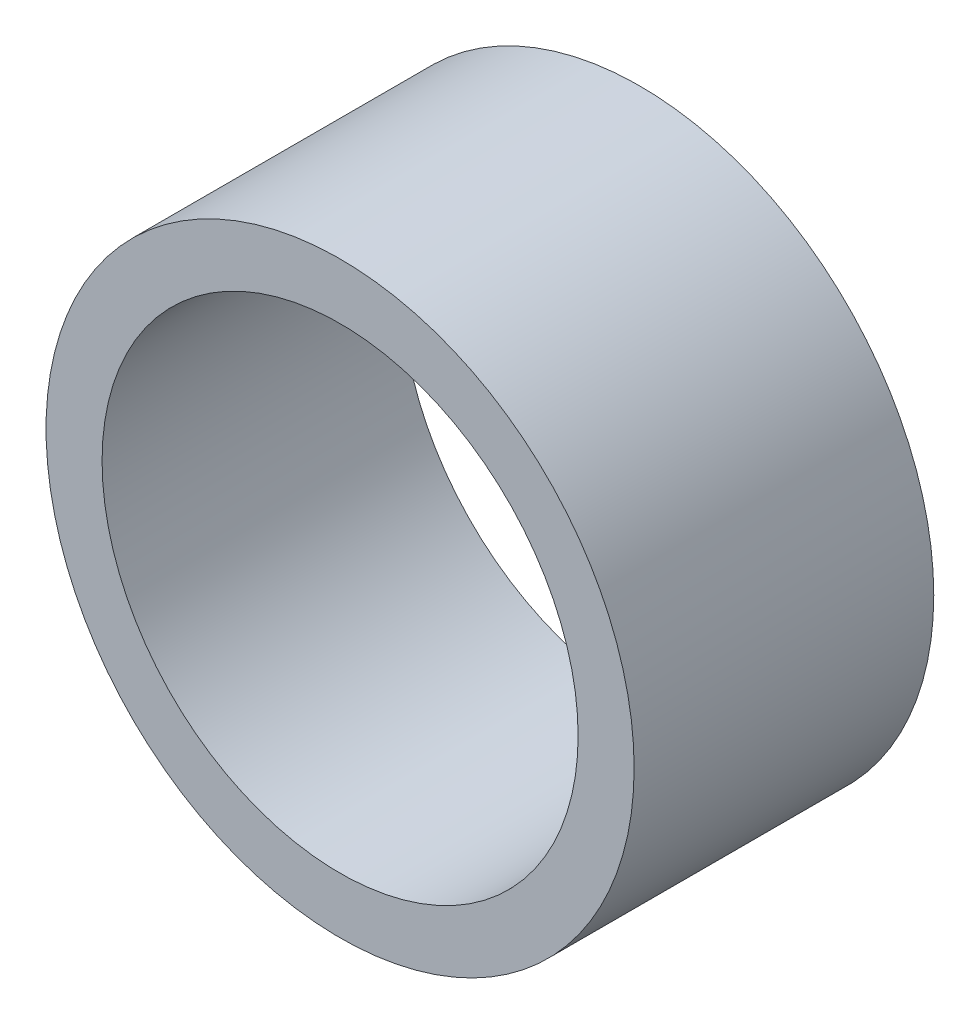
ISO-10303-21;
HEADER;
FILE_DESCRIPTION(('STEP AP214'),'2;1');
FILE_NAME('part.step','',(''),(''),'','','');
FILE_SCHEMA(('AUTOMOTIVE_DESIGN { 1 0 10303 214 1 1 1 1 }'));
ENDSEC;
DATA;
#1=APPLICATION_CONTEXT('core data for automotive mechanical design processes');
#2=APPLICATION_PROTOCOL_DEFINITION('international standard','automotive_design',2000,#1);
#3=PRODUCT_CONTEXT('',#1,'mechanical');
#4=PRODUCT('Part','Part','',(#3));
#5=PRODUCT_RELATED_PRODUCT_CATEGORY('part','',(#4));
#6=PRODUCT_DEFINITION_FORMATION('','',#4);
#7=PRODUCT_DEFINITION_CONTEXT('part definition',#1,'design');
#8=PRODUCT_DEFINITION('design','',#6,#7);
#9=PRODUCT_DEFINITION_SHAPE('','',#8);
#10=(LENGTH_UNIT() NAMED_UNIT(*) SI_UNIT(.MILLI.,.METRE.));
#11=(NAMED_UNIT(*) PLANE_ANGLE_UNIT() SI_UNIT($,.RADIAN.));
#12=(NAMED_UNIT(*) SI_UNIT($,.STERADIAN.) SOLID_ANGLE_UNIT());
#13=UNCERTAINTY_MEASURE_WITH_UNIT(LENGTH_MEASURE(1.E-05),#10,'distance_accuracy_value','');
#14=(GEOMETRIC_REPRESENTATION_CONTEXT(3) GLOBAL_UNCERTAINTY_ASSIGNED_CONTEXT((#13)) GLOBAL_UNIT_ASSIGNED_CONTEXT((#10,
#11,#12)) REPRESENTATION_CONTEXT('',''));
#15=CARTESIAN_POINT('',(0.,0.,0.));
#16=DIRECTION('',(0.,0.,1.));
#17=DIRECTION('',(1.,0.,0.));
#18=AXIS2_PLACEMENT_3D('',#15,#16,#17);
#19=CARTESIAN_POINT('',(0.,0.,10.7));
#20=DIRECTION('',(0.,0.,1.));
#21=DIRECTION('',(1.,0.,0.));
#22=AXIS2_PLACEMENT_3D('',#19,#20,#21);
#23=PLANE('',#22);
#24=CARTESIAN_POINT('',(0.,0.,10.7));
#25=DIRECTION('',(0.,0.,1.));
#26=DIRECTION('',(1.,0.,0.));
#27=AXIS2_PLACEMENT_3D('',#24,#25,#26);
#28=CIRCLE('',#27,10.5);
#29=CARTESIAN_POINT('',(10.5,0.,10.7));
#30=VERTEX_POINT('',#29);
#31=EDGE_CURVE('E10',#30,#30,#28,.T.);
#32=ORIENTED_EDGE('',*,*,#31,.T.);
#33=EDGE_LOOP('',(#32));
#34=FACE_BOUND('',#33,.T.);
#35=CARTESIAN_POINT('',(0.,0.,10.7));
#36=DIRECTION('',(0.,0.,1.));
#37=DIRECTION('',(1.,0.,0.));
#38=AXIS2_PLACEMENT_3D('',#35,#36,#37);
#39=CIRCLE('',#38,8.5);
#40=CARTESIAN_POINT('',(8.5,0.,10.7));
#41=VERTEX_POINT('',#40);
#42=EDGE_CURVE('E42',#41,#41,#39,.T.);
#43=ORIENTED_EDGE('',*,*,#42,.F.);
#44=EDGE_LOOP('',(#43));
#45=FACE_BOUND('',#44,.T.);
#46=ADVANCED_FACE('F31',(#34,#45),#23,.T.);
#47=CARTESIAN_POINT('',(0.,0.,0.));
#48=DIRECTION('',(0.,0.,1.));
#49=DIRECTION('',(1.,0.,0.));
#50=AXIS2_PLACEMENT_3D('',#47,#48,#49);
#51=PLANE('',#50);
#52=CARTESIAN_POINT('',(0.,0.,0.));
#53=DIRECTION('',(0.,0.,1.));
#54=DIRECTION('',(1.,0.,0.));
#55=AXIS2_PLACEMENT_3D('',#52,#53,#54);
#56=CIRCLE('',#55,10.5);
#57=CARTESIAN_POINT('',(10.5,0.,0.));
#58=VERTEX_POINT('',#57);
#59=EDGE_CURVE('E35',#58,#58,#56,.T.);
#60=ORIENTED_EDGE('',*,*,#59,.F.);
#61=EDGE_LOOP('',(#60));
#62=FACE_BOUND('',#61,.T.);
#63=CARTESIAN_POINT('',(0.,0.,0.));
#64=DIRECTION('',(0.,0.,1.));
#65=DIRECTION('',(1.,0.,0.));
#66=AXIS2_PLACEMENT_3D('',#63,#64,#65);
#67=CIRCLE('',#66,8.5);
#68=CARTESIAN_POINT('',(8.5,0.,0.));
#69=VERTEX_POINT('',#68);
#70=EDGE_CURVE('E44',#69,#69,#67,.T.);
#71=ORIENTED_EDGE('',*,*,#70,.T.);
#72=EDGE_LOOP('',(#71));
#73=FACE_BOUND('',#72,.T.);
#74=ADVANCED_FACE('F54',(#62,#73),#51,.F.);
#75=CARTESIAN_POINT('',(0.,0.,10.7));
#76=DIRECTION('',(0.,0.,-1.));
#77=DIRECTION('',(-1.,0.,0.));
#78=AXIS2_PLACEMENT_3D('',#75,#76,#77);
#79=CYLINDRICAL_SURFACE('',#78,10.5);
#80=ORIENTED_EDGE('',*,*,#31,.F.);
#81=EDGE_LOOP('',(#80));
#82=FACE_BOUND('',#81,.T.);
#83=ORIENTED_EDGE('',*,*,#59,.T.);
#84=EDGE_LOOP('',(#83));
#85=FACE_BOUND('',#84,.T.);
#86=ADVANCED_FACE('F33',(#82,#85),#79,.T.);
#87=CARTESIAN_POINT('',(0.,0.,10.7));
#88=DIRECTION('',(0.,0.,-1.));
#89=DIRECTION('',(-1.,0.,0.));
#90=AXIS2_PLACEMENT_3D('',#87,#88,#89);
#91=CYLINDRICAL_SURFACE('',#90,8.5);
#92=ORIENTED_EDGE('',*,*,#42,.T.);
#93=EDGE_LOOP('',(#92));
#94=FACE_BOUND('',#93,.T.);
#95=ORIENTED_EDGE('',*,*,#70,.F.);
#96=EDGE_LOOP('',(#95));
#97=FACE_BOUND('',#96,.T.);
#98=ADVANCED_FACE('F50',(#94,#97),#91,.F.);
#99=CLOSED_SHELL('',(#46,#74,#86,#98));
#100=MANIFOLD_SOLID_BREP('B2',#99);
#101=ADVANCED_BREP_SHAPE_REPRESENTATION('',(#18,#100),#14);
#102=SHAPE_DEFINITION_REPRESENTATION(#9,#101);
ENDSEC;
END-ISO-10303-21;
